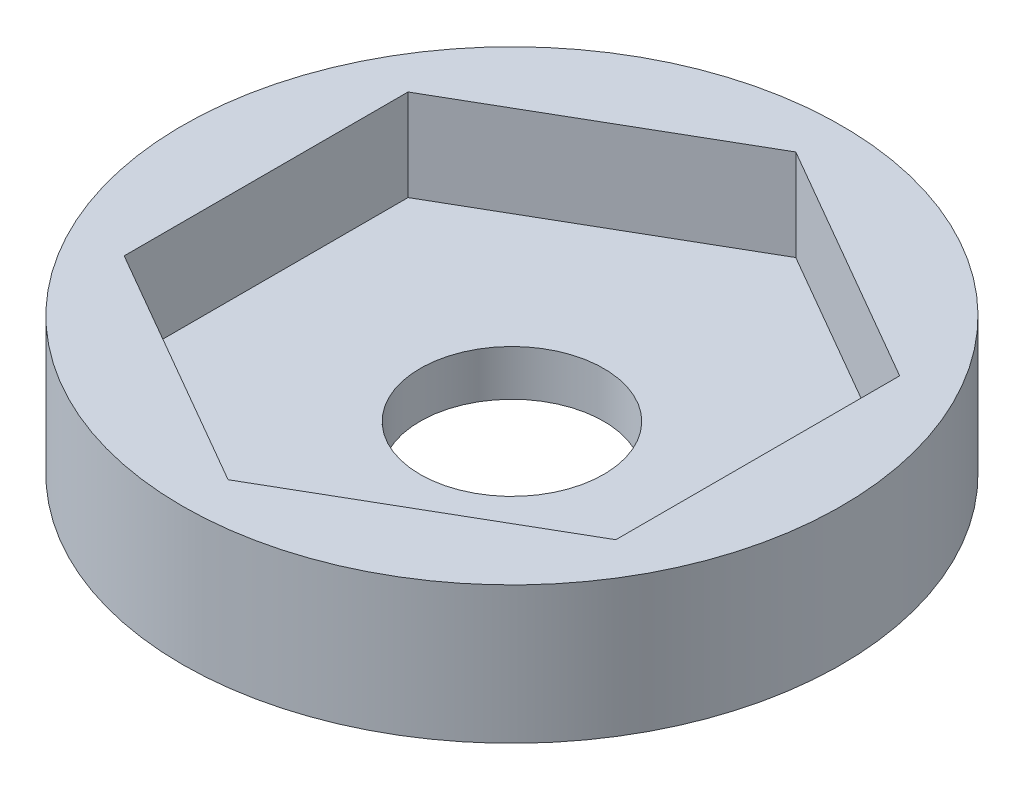
ISO-10303-21;
HEADER;
FILE_DESCRIPTION(('STEP AP214'),'2;1');
FILE_NAME('part.step','',(''),(''),'','','');
FILE_SCHEMA(('AUTOMOTIVE_DESIGN { 1 0 10303 214 1 1 1 1 }'));
ENDSEC;
DATA;
#1=APPLICATION_CONTEXT('core data for automotive mechanical design processes');
#2=APPLICATION_PROTOCOL_DEFINITION('international standard','automotive_design',2000,#1);
#3=PRODUCT_CONTEXT('',#1,'mechanical');
#4=PRODUCT('Part','Part','',(#3));
#5=PRODUCT_RELATED_PRODUCT_CATEGORY('part','',(#4));
#6=PRODUCT_DEFINITION_FORMATION('','',#4);
#7=PRODUCT_DEFINITION_CONTEXT('part definition',#1,'design');
#8=PRODUCT_DEFINITION('design','',#6,#7);
#9=PRODUCT_DEFINITION_SHAPE('','',#8);
#10=(LENGTH_UNIT() NAMED_UNIT(*) SI_UNIT(.MILLI.,.METRE.));
#11=(NAMED_UNIT(*) PLANE_ANGLE_UNIT() SI_UNIT($,.RADIAN.));
#12=(NAMED_UNIT(*) SI_UNIT($,.STERADIAN.) SOLID_ANGLE_UNIT());
#13=UNCERTAINTY_MEASURE_WITH_UNIT(LENGTH_MEASURE(1.E-05),#10,'distance_accuracy_value','');
#14=(GEOMETRIC_REPRESENTATION_CONTEXT(3) GLOBAL_UNCERTAINTY_ASSIGNED_CONTEXT((#13)) GLOBAL_UNIT_ASSIGNED_CONTEXT((#10,
#11,#12)) REPRESENTATION_CONTEXT('',''));
#15=CARTESIAN_POINT('',(0.,0.,0.));
#16=DIRECTION('',(0.,0.,1.));
#17=DIRECTION('',(1.,0.,0.));
#18=AXIS2_PLACEMENT_3D('',#15,#16,#17);
#19=CARTESIAN_POINT('',(0.,3.175,0.));
#20=DIRECTION('',(0.,1.,0.));
#21=DIRECTION('',(0.,0.,1.));
#22=AXIS2_PLACEMENT_3D('',#19,#20,#21);
#23=PLANE('',#22);
#24=CARTESIAN_POINT('',(0.,3.175,0.));
#25=DIRECTION('',(0.,1.,0.));
#26=DIRECTION('',(0.,0.,1.));
#27=AXIS2_PLACEMENT_3D('',#24,#25,#26);
#28=CIRCLE('',#27,11.4421762747439);
#29=CARTESIAN_POINT('',(0.,3.175,11.4421762747439));
#30=VERTEX_POINT('',#29);
#31=EDGE_CURVE('E11',#30,#30,#28,.T.);
#32=ORIENTED_EDGE('',*,*,#31,.T.);
#33=EDGE_LOOP('',(#32));
#34=FACE_BOUND('',#33,.T.);
#35=DIRECTION('',(-0.866025403784438,0.,-0.5));
#36=VECTOR('',#35,1.);
#37=CARTESIAN_POINT('',(8.53440000000001,3.175,-4.92733813737194));
#38=LINE('',#37,#36);
#39=CARTESIAN_POINT('',(8.53440000000001,3.175,-4.92733813737194));
#40=VERTEX_POINT('',#39);
#41=CARTESIAN_POINT('',(0.,3.175,-9.85467627474389));
#42=VERTEX_POINT('',#41);
#43=EDGE_CURVE('E103',#40,#42,#38,.T.);
#44=ORIENTED_EDGE('',*,*,#43,.F.);
#45=DIRECTION('',(0.,0.,-1.));
#46=VECTOR('',#45,1.);
#47=CARTESIAN_POINT('',(8.53440000000001,3.175,4.92733813737195));
#48=LINE('',#47,#46);
#49=CARTESIAN_POINT('',(8.53440000000001,3.175,4.92733813737195));
#50=VERTEX_POINT('',#49);
#51=EDGE_CURVE('E83',#50,#40,#48,.T.);
#52=ORIENTED_EDGE('',*,*,#51,.F.);
#53=DIRECTION('',(0.866025403784439,0.,-0.5));
#54=VECTOR('',#53,1.);
#55=CARTESIAN_POINT('',(0.,3.175,9.85467627474389));
#56=LINE('',#55,#54);
#57=CARTESIAN_POINT('',(0.,3.175,9.85467627474388));
#58=VERTEX_POINT('',#57);
#59=EDGE_CURVE('E54',#58,#50,#56,.T.);
#60=ORIENTED_EDGE('',*,*,#59,.F.);
#61=DIRECTION('',(0.866025403784438,0.,0.5));
#62=VECTOR('',#61,1.);
#63=CARTESIAN_POINT('',(-8.5344,3.175,4.92733813737194));
#64=LINE('',#63,#62);
#65=CARTESIAN_POINT('',(-8.5344,3.175,4.92733813737194));
#66=VERTEX_POINT('',#65);
#67=EDGE_CURVE('E114',#66,#58,#64,.T.);
#68=ORIENTED_EDGE('',*,*,#67,.F.);
#69=DIRECTION('',(0.,0.,1.));
#70=VECTOR('',#69,1.);
#71=CARTESIAN_POINT('',(-8.5344,3.175,-4.92733813737195));
#72=LINE('',#71,#70);
#73=CARTESIAN_POINT('',(-8.5344,3.175,-4.92733813737195));
#74=VERTEX_POINT('',#73);
#75=EDGE_CURVE('E102',#74,#66,#72,.T.);
#76=ORIENTED_EDGE('',*,*,#75,.F.);
#77=DIRECTION('',(-0.866025403784439,0.,0.5));
#78=VECTOR('',#77,1.);
#79=CARTESIAN_POINT('',(0.,3.175,-9.85467627474389));
#80=LINE('',#79,#78);
#81=EDGE_CURVE('E92',#42,#74,#80,.T.);
#82=ORIENTED_EDGE('',*,*,#81,.F.);
#83=EDGE_LOOP('',(#44,#52,#60,#68,#76,#82));
#84=FACE_BOUND('',#83,.T.);
#85=ADVANCED_FACE('F33',(#34,#84),#23,.T.);
#86=CARTESIAN_POINT('',(0.,3.175,0.));
#87=DIRECTION('',(0.,-1.,0.));
#88=DIRECTION('',(0.,0.,-1.));
#89=AXIS2_PLACEMENT_3D('',#86,#87,#88);
#90=CYLINDRICAL_SURFACE('',#89,11.4421762747439);
#91=ORIENTED_EDGE('',*,*,#31,.F.);
#92=EDGE_LOOP('',(#91));
#93=FACE_BOUND('',#92,.T.);
#94=CARTESIAN_POINT('',(0.,-1.5875,0.));
#95=DIRECTION('',(0.,1.,0.));
#96=DIRECTION('',(0.,0.,1.));
#97=AXIS2_PLACEMENT_3D('',#94,#95,#96);
#98=CIRCLE('',#97,11.4421762747439);
#99=CARTESIAN_POINT('',(0.,-1.5875,11.4421762747439));
#100=VERTEX_POINT('',#99);
#101=EDGE_CURVE('E125',#100,#100,#98,.T.);
#102=ORIENTED_EDGE('',*,*,#101,.T.);
#103=EDGE_LOOP('',(#102));
#104=FACE_BOUND('',#103,.T.);
#105=ADVANCED_FACE('F35',(#93,#104),#90,.T.);
#106=CARTESIAN_POINT('',(8.53440000000001,3.175,4.92733813737195));
#107=DIRECTION('',(-1.,0.,0.));
#108=DIRECTION('',(0.,0.,1.));
#109=AXIS2_PLACEMENT_3D('',#106,#107,#108);
#110=PLANE('',#109);
#111=DIRECTION('',(0.,0.,-1.));
#112=VECTOR('',#111,1.);
#113=CARTESIAN_POINT('',(8.53440000000001,0.,4.92733813737195));
#114=LINE('',#113,#112);
#115=CARTESIAN_POINT('',(8.53440000000001,0.,4.92733813737195));
#116=VERTEX_POINT('',#115);
#117=CARTESIAN_POINT('',(8.53440000000001,0.,-4.92733813737194));
#118=VERTEX_POINT('',#117);
#119=EDGE_CURVE('E121',#116,#118,#114,.T.);
#120=ORIENTED_EDGE('',*,*,#119,.F.);
#121=DIRECTION('',(0.,-1.,0.));
#122=VECTOR('',#121,1.);
#123=CARTESIAN_POINT('',(8.53440000000001,3.175,4.92733813737195));
#124=LINE('',#123,#122);
#125=EDGE_CURVE('E120',#50,#116,#124,.T.);
#126=ORIENTED_EDGE('',*,*,#125,.F.);
#127=ORIENTED_EDGE('',*,*,#51,.T.);
#128=DIRECTION('',(0.,-1.,0.));
#129=VECTOR('',#128,1.);
#130=CARTESIAN_POINT('',(8.53440000000001,3.175,-4.92733813737194));
#131=LINE('',#130,#129);
#132=EDGE_CURVE('E41',#40,#118,#131,.T.);
#133=ORIENTED_EDGE('',*,*,#132,.T.);
#134=EDGE_LOOP('',(#120,#126,#127,#133));
#135=FACE_BOUND('',#134,.T.);
#136=ADVANCED_FACE('F141',(#135),#110,.T.);
#137=CARTESIAN_POINT('',(8.53440000000001,3.175,-4.92733813737194));
#138=DIRECTION('',(-0.5,0.,0.866025403784438));
#139=DIRECTION('',(0.866025403784439,0.,0.5));
#140=AXIS2_PLACEMENT_3D('',#137,#138,#139);
#141=PLANE('',#140);
#142=DIRECTION('',(-0.866025403784438,0.,-0.5));
#143=VECTOR('',#142,1.);
#144=CARTESIAN_POINT('',(8.53440000000001,0.,-4.92733813737194));
#145=LINE('',#144,#143);
#146=CARTESIAN_POINT('',(0.,0.,-9.85467627474389));
#147=VERTEX_POINT('',#146);
#148=EDGE_CURVE('E124',#118,#147,#145,.T.);
#149=ORIENTED_EDGE('',*,*,#148,.F.);
#150=ORIENTED_EDGE('',*,*,#132,.F.);
#151=ORIENTED_EDGE('',*,*,#43,.T.);
#152=DIRECTION('',(0.,-1.,0.));
#153=VECTOR('',#152,1.);
#154=CARTESIAN_POINT('',(0.,3.175,-9.85467627474389));
#155=LINE('',#154,#153);
#156=EDGE_CURVE('E98',#42,#147,#155,.T.);
#157=ORIENTED_EDGE('',*,*,#156,.T.);
#158=EDGE_LOOP('',(#149,#150,#151,#157));
#159=FACE_BOUND('',#158,.T.);
#160=ADVANCED_FACE('F182',(#159),#141,.T.);
#161=CARTESIAN_POINT('',(0.,3.175,-9.85467627474389));
#162=DIRECTION('',(0.5,0.,0.866025403784439));
#163=DIRECTION('',(0.866025403784439,0.,-0.5));
#164=AXIS2_PLACEMENT_3D('',#161,#162,#163);
#165=PLANE('',#164);
#166=DIRECTION('',(-0.866025403784439,0.,0.5));
#167=VECTOR('',#166,1.);
#168=CARTESIAN_POINT('',(0.,0.,-9.85467627474389));
#169=LINE('',#168,#167);
#170=CARTESIAN_POINT('',(-8.5344,0.,-4.92733813737195));
#171=VERTEX_POINT('',#170);
#172=EDGE_CURVE('E128',#147,#171,#169,.T.);
#173=ORIENTED_EDGE('',*,*,#172,.F.);
#174=ORIENTED_EDGE('',*,*,#156,.F.);
#175=ORIENTED_EDGE('',*,*,#81,.T.);
#176=DIRECTION('',(0.,-1.,0.));
#177=VECTOR('',#176,1.);
#178=CARTESIAN_POINT('',(-8.5344,3.175,-4.92733813737195));
#179=LINE('',#178,#177);
#180=EDGE_CURVE('E96',#74,#171,#179,.T.);
#181=ORIENTED_EDGE('',*,*,#180,.T.);
#182=EDGE_LOOP('',(#173,#174,#175,#181));
#183=FACE_BOUND('',#182,.T.);
#184=ADVANCED_FACE('F95',(#183),#165,.T.);
#185=CARTESIAN_POINT('',(-8.5344,3.175,-4.92733813737195));
#186=DIRECTION('',(1.,0.,0.));
#187=DIRECTION('',(0.,0.,-1.));
#188=AXIS2_PLACEMENT_3D('',#185,#186,#187);
#189=PLANE('',#188);
#190=DIRECTION('',(0.,0.,1.));
#191=VECTOR('',#190,1.);
#192=CARTESIAN_POINT('',(-8.5344,0.,-4.92733813737195));
#193=LINE('',#192,#191);
#194=CARTESIAN_POINT('',(-8.5344,0.,4.92733813737194));
#195=VERTEX_POINT('',#194);
#196=EDGE_CURVE('E109',#171,#195,#193,.T.);
#197=ORIENTED_EDGE('',*,*,#196,.F.);
#198=ORIENTED_EDGE('',*,*,#180,.F.);
#199=ORIENTED_EDGE('',*,*,#75,.T.);
#200=DIRECTION('',(0.,-1.,0.));
#201=VECTOR('',#200,1.);
#202=CARTESIAN_POINT('',(-8.5344,3.175,4.92733813737194));
#203=LINE('',#202,#201);
#204=EDGE_CURVE('E111',#66,#195,#203,.T.);
#205=ORIENTED_EDGE('',*,*,#204,.T.);
#206=EDGE_LOOP('',(#197,#198,#199,#205));
#207=FACE_BOUND('',#206,.T.);
#208=ADVANCED_FACE('F106',(#207),#189,.T.);
#209=CARTESIAN_POINT('',(-8.5344,3.175,4.92733813737194));
#210=DIRECTION('',(0.5,0.,-0.866025403784438));
#211=DIRECTION('',(-0.866025403784439,0.,-0.5));
#212=AXIS2_PLACEMENT_3D('',#209,#210,#211);
#213=PLANE('',#212);
#214=DIRECTION('',(0.866025403784438,0.,0.5));
#215=VECTOR('',#214,1.);
#216=CARTESIAN_POINT('',(-8.5344,0.,4.92733813737194));
#217=LINE('',#216,#215);
#218=CARTESIAN_POINT('',(0.,0.,9.85467627474389));
#219=VERTEX_POINT('',#218);
#220=EDGE_CURVE('E131',#195,#219,#217,.T.);
#221=ORIENTED_EDGE('',*,*,#220,.F.);
#222=ORIENTED_EDGE('',*,*,#204,.F.);
#223=ORIENTED_EDGE('',*,*,#67,.T.);
#224=DIRECTION('',(0.,-1.,0.));
#225=VECTOR('',#224,1.);
#226=CARTESIAN_POINT('',(0.,3.175,9.85467627474389));
#227=LINE('',#226,#225);
#228=EDGE_CURVE('E48',#58,#219,#227,.T.);
#229=ORIENTED_EDGE('',*,*,#228,.T.);
#230=EDGE_LOOP('',(#221,#222,#223,#229));
#231=FACE_BOUND('',#230,.T.);
#232=ADVANCED_FACE('F189',(#231),#213,.T.);
#233=CARTESIAN_POINT('',(0.,3.175,9.85467627474389));
#234=DIRECTION('',(-0.5,0.,-0.866025403784439));
#235=DIRECTION('',(-0.866025403784439,0.,0.5));
#236=AXIS2_PLACEMENT_3D('',#233,#234,#235);
#237=PLANE('',#236);
#238=DIRECTION('',(0.866025403784439,0.,-0.5));
#239=VECTOR('',#238,1.);
#240=CARTESIAN_POINT('',(0.,0.,9.85467627474389));
#241=LINE('',#240,#239);
#242=EDGE_CURVE('E134',#219,#116,#241,.T.);
#243=ORIENTED_EDGE('',*,*,#242,.F.);
#244=ORIENTED_EDGE('',*,*,#228,.F.);
#245=ORIENTED_EDGE('',*,*,#59,.T.);
#246=ORIENTED_EDGE('',*,*,#125,.T.);
#247=EDGE_LOOP('',(#243,#244,#245,#246));
#248=FACE_BOUND('',#247,.T.);
#249=ADVANCED_FACE('F146',(#248),#237,.T.);
#250=CARTESIAN_POINT('',(0.,-1.5875,0.));
#251=DIRECTION('',(0.,1.,0.));
#252=DIRECTION('',(0.,0.,1.));
#253=AXIS2_PLACEMENT_3D('',#250,#251,#252);
#254=PLANE('',#253);
#255=CARTESIAN_POINT('',(0.,-1.5875,0.));
#256=DIRECTION('',(0.,1.,0.));
#257=DIRECTION('',(0.,0.,1.));
#258=AXIS2_PLACEMENT_3D('',#255,#256,#257);
#259=CIRCLE('',#258,3.1877);
#260=CARTESIAN_POINT('',(0.,-1.5875,3.1877));
#261=VERTEX_POINT('',#260);
#262=EDGE_CURVE('E151',#261,#261,#259,.T.);
#263=ORIENTED_EDGE('',*,*,#262,.T.);
#264=EDGE_LOOP('',(#263));
#265=FACE_BOUND('',#264,.T.);
#266=ORIENTED_EDGE('',*,*,#101,.F.);
#267=EDGE_LOOP('',(#266));
#268=FACE_BOUND('',#267,.T.);
#269=ADVANCED_FACE('F158',(#265,#268),#254,.F.);
#270=CARTESIAN_POINT('',(0.,0.,0.));
#271=DIRECTION('',(0.,1.,0.));
#272=DIRECTION('',(0.,0.,1.));
#273=AXIS2_PLACEMENT_3D('',#270,#271,#272);
#274=PLANE('',#273);
#275=ORIENTED_EDGE('',*,*,#242,.T.);
#276=ORIENTED_EDGE('',*,*,#119,.T.);
#277=ORIENTED_EDGE('',*,*,#148,.T.);
#278=ORIENTED_EDGE('',*,*,#172,.T.);
#279=ORIENTED_EDGE('',*,*,#196,.T.);
#280=ORIENTED_EDGE('',*,*,#220,.T.);
#281=EDGE_LOOP('',(#275,#276,#277,#278,#279,#280));
#282=FACE_BOUND('',#281,.T.);
#283=CARTESIAN_POINT('',(0.,0.,0.));
#284=DIRECTION('',(0.,1.,0.));
#285=DIRECTION('',(0.,0.,1.));
#286=AXIS2_PLACEMENT_3D('',#283,#284,#285);
#287=CIRCLE('',#286,3.1877);
#288=CARTESIAN_POINT('',(0.,0.,3.1877));
#289=VERTEX_POINT('',#288);
#290=EDGE_CURVE('E152',#289,#289,#287,.T.);
#291=ORIENTED_EDGE('',*,*,#290,.F.);
#292=EDGE_LOOP('',(#291));
#293=FACE_BOUND('',#292,.T.);
#294=ADVANCED_FACE('F144',(#282,#293),#274,.T.);
#295=CARTESIAN_POINT('',(0.,-1.5875,0.));
#296=DIRECTION('',(0.,1.,0.));
#297=DIRECTION('',(0.,0.,1.));
#298=AXIS2_PLACEMENT_3D('',#295,#296,#297);
#299=CYLINDRICAL_SURFACE('',#298,3.1877);
#300=ORIENTED_EDGE('',*,*,#262,.F.);
#301=EDGE_LOOP('',(#300));
#302=FACE_BOUND('',#301,.T.);
#303=ORIENTED_EDGE('',*,*,#290,.T.);
#304=EDGE_LOOP('',(#303));
#305=FACE_BOUND('',#304,.T.);
#306=ADVANCED_FACE('F161',(#302,#305),#299,.F.);
#307=CLOSED_SHELL('',(#85,#105,#136,#160,#184,#208,#232,#249,#269,#294,#306));
#308=MANIFOLD_SOLID_BREP('B2',#307);
#309=ADVANCED_BREP_SHAPE_REPRESENTATION('',(#18,#308),#14);
#310=SHAPE_DEFINITION_REPRESENTATION(#9,#309);
ENDSEC;
END-ISO-10303-21;
